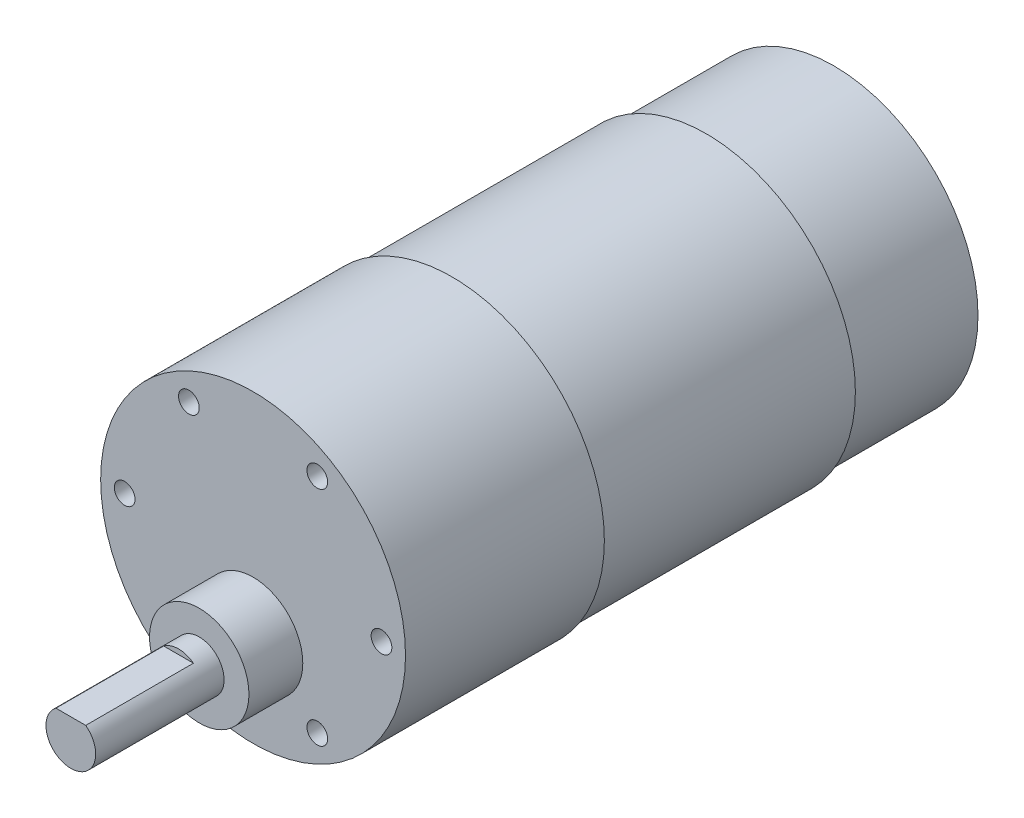
ISO-10303-21;
HEADER;
FILE_DESCRIPTION(('STEP AP214'),'2;1');
FILE_NAME('part.step','',(''),(''),'','','');
FILE_SCHEMA(('AUTOMOTIVE_DESIGN { 1 0 10303 214 1 1 1 1 }'));
ENDSEC;
DATA;
#1=APPLICATION_CONTEXT('core data for automotive mechanical design processes');
#2=APPLICATION_PROTOCOL_DEFINITION('international standard','automotive_design',2000,#1);
#3=PRODUCT_CONTEXT('',#1,'mechanical');
#4=PRODUCT('Part','Part','',(#3));
#5=PRODUCT_RELATED_PRODUCT_CATEGORY('part','',(#4));
#6=PRODUCT_DEFINITION_FORMATION('','',#4);
#7=PRODUCT_DEFINITION_CONTEXT('part definition',#1,'design');
#8=PRODUCT_DEFINITION('design','',#6,#7);
#9=PRODUCT_DEFINITION_SHAPE('','',#8);
#10=(LENGTH_UNIT() NAMED_UNIT(*) SI_UNIT(.MILLI.,.METRE.));
#11=(NAMED_UNIT(*) PLANE_ANGLE_UNIT() SI_UNIT($,.RADIAN.));
#12=(NAMED_UNIT(*) SI_UNIT($,.STERADIAN.) SOLID_ANGLE_UNIT());
#13=UNCERTAINTY_MEASURE_WITH_UNIT(LENGTH_MEASURE(1.E-05),#10,'distance_accuracy_value','');
#14=(GEOMETRIC_REPRESENTATION_CONTEXT(3) GLOBAL_UNCERTAINTY_ASSIGNED_CONTEXT((#13)) GLOBAL_UNIT_ASSIGNED_CONTEXT((#10,
#11,#12)) REPRESENTATION_CONTEXT('',''));
#15=CARTESIAN_POINT('',(0.,0.,0.));
#16=DIRECTION('',(0.,0.,1.));
#17=DIRECTION('',(1.,0.,0.));
#18=AXIS2_PLACEMENT_3D('',#15,#16,#17);
#19=CARTESIAN_POINT('',(0.,0.,15.4));
#20=DIRECTION('',(0.,0.,-1.));
#21=DIRECTION('',(-1.,0.,0.));
#22=AXIS2_PLACEMENT_3D('',#19,#20,#21);
#23=CYLINDRICAL_SURFACE('',#22,17.4);
#24=CARTESIAN_POINT('',(0.,0.,15.4));
#25=DIRECTION('',(0.,0.,1.));
#26=DIRECTION('',(1.,0.,0.));
#27=AXIS2_PLACEMENT_3D('',#24,#25,#26);
#28=CIRCLE('',#27,17.4);
#29=CARTESIAN_POINT('',(17.4,0.,15.4));
#30=VERTEX_POINT('',#29);
#31=EDGE_CURVE('E11',#30,#30,#28,.T.);
#32=ORIENTED_EDGE('',*,*,#31,.F.);
#33=EDGE_LOOP('',(#32));
#34=FACE_BOUND('',#33,.T.);
#35=CARTESIAN_POINT('',(0.,0.,0.));
#36=DIRECTION('',(0.,0.,1.));
#37=DIRECTION('',(1.,0.,0.));
#38=AXIS2_PLACEMENT_3D('',#35,#36,#37);
#39=CIRCLE('',#38,17.4);
#40=CARTESIAN_POINT('',(17.4,0.,0.));
#41=VERTEX_POINT('',#40);
#42=EDGE_CURVE('E37',#41,#41,#39,.T.);
#43=ORIENTED_EDGE('',*,*,#42,.T.);
#44=EDGE_LOOP('',(#43));
#45=FACE_BOUND('',#44,.T.);
#46=ADVANCED_FACE('F34',(#34,#45),#23,.T.);
#47=CARTESIAN_POINT('',(0.,0.,0.));
#48=DIRECTION('',(0.,0.,1.));
#49=DIRECTION('',(1.,0.,0.));
#50=AXIS2_PLACEMENT_3D('',#47,#48,#49);
#51=PLANE('',#50);
#52=ORIENTED_EDGE('',*,*,#42,.F.);
#53=EDGE_LOOP('',(#52));
#54=FACE_BOUND('',#53,.T.);
#55=ADVANCED_FACE('F113',(#54),#51,.F.);
#56=CARTESIAN_POINT('',(0.,0.,46.1));
#57=DIRECTION('',(0.,0.,-1.));
#58=DIRECTION('',(-1.,0.,0.));
#59=AXIS2_PLACEMENT_3D('',#56,#57,#58);
#60=CYLINDRICAL_SURFACE('',#59,18.);
#61=CARTESIAN_POINT('',(0.,0.,46.1));
#62=DIRECTION('',(0.,0.,1.));
#63=DIRECTION('',(1.,0.,0.));
#64=AXIS2_PLACEMENT_3D('',#61,#62,#63);
#65=CIRCLE('',#64,18.);
#66=CARTESIAN_POINT('',(18.,0.,46.1));
#67=VERTEX_POINT('',#66);
#68=EDGE_CURVE('E93',#67,#67,#65,.T.);
#69=ORIENTED_EDGE('',*,*,#68,.F.);
#70=EDGE_LOOP('',(#69));
#71=FACE_BOUND('',#70,.T.);
#72=CARTESIAN_POINT('',(0.,0.,15.4));
#73=DIRECTION('',(0.,0.,1.));
#74=DIRECTION('',(1.,0.,0.));
#75=AXIS2_PLACEMENT_3D('',#72,#73,#74);
#76=CIRCLE('',#75,18.);
#77=CARTESIAN_POINT('',(18.,0.,15.4));
#78=VERTEX_POINT('',#77);
#79=EDGE_CURVE('E90',#78,#78,#76,.T.);
#80=ORIENTED_EDGE('',*,*,#79,.T.);
#81=EDGE_LOOP('',(#80));
#82=FACE_BOUND('',#81,.T.);
#83=ADVANCED_FACE('F99',(#71,#82),#60,.T.);
#84=CARTESIAN_POINT('',(0.,0.,15.4));
#85=DIRECTION('',(0.,0.,1.));
#86=DIRECTION('',(1.,0.,0.));
#87=AXIS2_PLACEMENT_3D('',#84,#85,#86);
#88=PLANE('',#87);
#89=ORIENTED_EDGE('',*,*,#31,.T.);
#90=EDGE_LOOP('',(#89));
#91=FACE_BOUND('',#90,.T.);
#92=ORIENTED_EDGE('',*,*,#79,.F.);
#93=EDGE_LOOP('',(#92));
#94=FACE_BOUND('',#93,.T.);
#95=ADVANCED_FACE('F101',(#91,#94),#88,.F.);
#96=CARTESIAN_POINT('',(0.,0.,70.1));
#97=DIRECTION('',(0.,0.,-1.));
#98=DIRECTION('',(-1.,0.,0.));
#99=AXIS2_PLACEMENT_3D('',#96,#97,#98);
#100=CYLINDRICAL_SURFACE('',#99,18.4);
#101=CARTESIAN_POINT('',(0.,0.,70.1));
#102=DIRECTION('',(0.,0.,1.));
#103=DIRECTION('',(1.,0.,0.));
#104=AXIS2_PLACEMENT_3D('',#101,#102,#103);
#105=CIRCLE('',#104,18.4);
#106=CARTESIAN_POINT('',(18.4,0.,70.1));
#107=VERTEX_POINT('',#106);
#108=EDGE_CURVE('E87',#107,#107,#105,.T.);
#109=ORIENTED_EDGE('',*,*,#108,.F.);
#110=EDGE_LOOP('',(#109));
#111=FACE_BOUND('',#110,.T.);
#112=CARTESIAN_POINT('',(0.,0.,46.1));
#113=DIRECTION('',(0.,0.,1.));
#114=DIRECTION('',(1.,0.,0.));
#115=AXIS2_PLACEMENT_3D('',#112,#113,#114);
#116=CIRCLE('',#115,18.4);
#117=CARTESIAN_POINT('',(18.4,0.,46.1));
#118=VERTEX_POINT('',#117);
#119=EDGE_CURVE('E85',#118,#118,#116,.T.);
#120=ORIENTED_EDGE('',*,*,#119,.T.);
#121=EDGE_LOOP('',(#120));
#122=FACE_BOUND('',#121,.T.);
#123=ADVANCED_FACE('F103',(#111,#122),#100,.T.);
#124=CARTESIAN_POINT('',(0.,0.,70.1));
#125=DIRECTION('',(0.,0.,1.));
#126=DIRECTION('',(1.,0.,0.));
#127=AXIS2_PLACEMENT_3D('',#124,#125,#126);
#128=PLANE('',#127);
#129=CARTESIAN_POINT('',(-15.5,0.,70.1));
#130=DIRECTION('',(0.,0.,1.));
#131=DIRECTION('',(1.,0.,0.));
#132=AXIS2_PLACEMENT_3D('',#129,#130,#131);
#133=CIRCLE('',#132,1.25);
#134=CARTESIAN_POINT('',(-14.25,0.,70.1));
#135=VERTEX_POINT('',#134);
#136=EDGE_CURVE('E345',#135,#135,#133,.T.);
#137=ORIENTED_EDGE('',*,*,#136,.F.);
#138=EDGE_LOOP('',(#137));
#139=FACE_BOUND('',#138,.T.);
#140=CARTESIAN_POINT('',(-7.74999999999997,13.4233937586588,70.1));
#141=DIRECTION('',(0.,0.,1.));
#142=DIRECTION('',(1.,0.,0.));
#143=AXIS2_PLACEMENT_3D('',#140,#141,#142);
#144=CIRCLE('',#143,1.25);
#145=CARTESIAN_POINT('',(-6.49999999999997,13.4233937586588,70.1));
#146=VERTEX_POINT('',#145);
#147=EDGE_CURVE('E347',#146,#146,#144,.T.);
#148=ORIENTED_EDGE('',*,*,#147,.F.);
#149=EDGE_LOOP('',(#148));
#150=FACE_BOUND('',#149,.T.);
#151=CARTESIAN_POINT('',(7.75000000000006,13.4233937586588,70.1));
#152=DIRECTION('',(0.,0.,1.));
#153=DIRECTION('',(1.,0.,0.));
#154=AXIS2_PLACEMENT_3D('',#151,#152,#153);
#155=CIRCLE('',#154,1.25);
#156=CARTESIAN_POINT('',(9.00000000000006,13.4233937586588,70.1));
#157=VERTEX_POINT('',#156);
#158=EDGE_CURVE('E355',#157,#157,#155,.T.);
#159=ORIENTED_EDGE('',*,*,#158,.F.);
#160=EDGE_LOOP('',(#159));
#161=FACE_BOUND('',#160,.T.);
#162=CARTESIAN_POINT('',(15.5,-1.08235921504137E-13,70.1));
#163=DIRECTION('',(0.,0.,1.));
#164=DIRECTION('',(1.,0.,0.));
#165=AXIS2_PLACEMENT_3D('',#162,#163,#164);
#166=CIRCLE('',#165,1.25);
#167=CARTESIAN_POINT('',(16.75,-1.08235921504137E-13,70.1));
#168=VERTEX_POINT('',#167);
#169=EDGE_CURVE('E361',#168,#168,#166,.T.);
#170=ORIENTED_EDGE('',*,*,#169,.F.);
#171=EDGE_LOOP('',(#170));
#172=FACE_BOUND('',#171,.T.);
#173=CARTESIAN_POINT('',(7.74999999999987,-13.4233937586589,70.1));
#174=DIRECTION('',(0.,0.,1.));
#175=DIRECTION('',(1.,0.,0.));
#176=AXIS2_PLACEMENT_3D('',#173,#174,#175);
#177=CIRCLE('',#176,1.25);
#178=CARTESIAN_POINT('',(8.99999999999987,-13.4233937586589,70.1));
#179=VERTEX_POINT('',#178);
#180=EDGE_CURVE('E367',#179,#179,#177,.T.);
#181=ORIENTED_EDGE('',*,*,#180,.F.);
#182=EDGE_LOOP('',(#181));
#183=FACE_BOUND('',#182,.T.);
#184=CARTESIAN_POINT('',(-7.75000000000016,-13.4233937586587,70.1));
#185=DIRECTION('',(0.,0.,1.));
#186=DIRECTION('',(1.,0.,0.));
#187=AXIS2_PLACEMENT_3D('',#184,#185,#186);
#188=CIRCLE('',#187,1.25);
#189=CARTESIAN_POINT('',(-6.50000000000016,-13.4233937586587,70.1));
#190=VERTEX_POINT('',#189);
#191=EDGE_CURVE('E373',#190,#190,#188,.T.);
#192=ORIENTED_EDGE('',*,*,#191,.F.);
#193=EDGE_LOOP('',(#192));
#194=FACE_BOUND('',#193,.T.);
#195=CARTESIAN_POINT('',(0.,-7.,70.1));
#196=DIRECTION('',(0.,0.,1.));
#197=DIRECTION('',(1.,0.,0.));
#198=AXIS2_PLACEMENT_3D('',#195,#196,#197);
#199=CIRCLE('',#198,6.);
#200=CARTESIAN_POINT('',(6.,-7.,70.1));
#201=VERTEX_POINT('',#200);
#202=EDGE_CURVE('E75',#201,#201,#199,.T.);
#203=ORIENTED_EDGE('',*,*,#202,.F.);
#204=EDGE_LOOP('',(#203));
#205=FACE_BOUND('',#204,.T.);
#206=ORIENTED_EDGE('',*,*,#108,.T.);
#207=EDGE_LOOP('',(#206));
#208=FACE_BOUND('',#207,.T.);
#209=ADVANCED_FACE('F110',(#139,#150,#161,#172,#183,#194,#205,#208),#128,.T.);
#210=CARTESIAN_POINT('',(0.,0.,46.1));
#211=DIRECTION('',(0.,0.,1.));
#212=DIRECTION('',(1.,0.,0.));
#213=AXIS2_PLACEMENT_3D('',#210,#211,#212);
#214=PLANE('',#213);
#215=ORIENTED_EDGE('',*,*,#68,.T.);
#216=EDGE_LOOP('',(#215));
#217=FACE_BOUND('',#216,.T.);
#218=ORIENTED_EDGE('',*,*,#119,.F.);
#219=EDGE_LOOP('',(#218));
#220=FACE_BOUND('',#219,.T.);
#221=ADVANCED_FACE('F149',(#217,#220),#214,.F.);
#222=CARTESIAN_POINT('',(0.,-7.,76.6));
#223=DIRECTION('',(0.,0.,-1.));
#224=DIRECTION('',(-1.,0.,0.));
#225=AXIS2_PLACEMENT_3D('',#222,#223,#224);
#226=CYLINDRICAL_SURFACE('',#225,6.);
#227=CARTESIAN_POINT('',(0.,-7.,76.6));
#228=DIRECTION('',(0.,0.,1.));
#229=DIRECTION('',(1.,0.,0.));
#230=AXIS2_PLACEMENT_3D('',#227,#228,#229);
#231=CIRCLE('',#230,6.);
#232=CARTESIAN_POINT('',(6.,-7.,76.6));
#233=VERTEX_POINT('',#232);
#234=EDGE_CURVE('E78',#233,#233,#231,.T.);
#235=ORIENTED_EDGE('',*,*,#234,.F.);
#236=EDGE_LOOP('',(#235));
#237=FACE_BOUND('',#236,.T.);
#238=ORIENTED_EDGE('',*,*,#202,.T.);
#239=EDGE_LOOP('',(#238));
#240=FACE_BOUND('',#239,.T.);
#241=ADVANCED_FACE('F154',(#237,#240),#226,.T.);
#242=CARTESIAN_POINT('',(0.,-7.,76.6));
#243=DIRECTION('',(0.,0.,1.));
#244=DIRECTION('',(1.,0.,0.));
#245=AXIS2_PLACEMENT_3D('',#242,#243,#244);
#246=PLANE('',#245);
#247=CARTESIAN_POINT('',(0.,-7.,76.6));
#248=DIRECTION('',(0.,0.,1.));
#249=DIRECTION('',(1.,0.,0.));
#250=AXIS2_PLACEMENT_3D('',#247,#248,#249);
#251=CIRCLE('',#250,3.);
#252=CARTESIAN_POINT('',(3.,-7.,76.6));
#253=VERTEX_POINT('',#252);
#254=EDGE_CURVE('E72',#253,#253,#251,.T.);
#255=ORIENTED_EDGE('',*,*,#254,.F.);
#256=EDGE_LOOP('',(#255));
#257=FACE_BOUND('',#256,.T.);
#258=ORIENTED_EDGE('',*,*,#234,.T.);
#259=EDGE_LOOP('',(#258));
#260=FACE_BOUND('',#259,.T.);
#261=ADVANCED_FACE('F164',(#257,#260),#246,.T.);
#262=CARTESIAN_POINT('',(0.,-7.,92.1));
#263=DIRECTION('',(0.,0.,-1.));
#264=DIRECTION('',(-1.,0.,0.));
#265=AXIS2_PLACEMENT_3D('',#262,#263,#264);
#266=CYLINDRICAL_SURFACE('',#265,3.);
#267=CARTESIAN_POINT('',(0.,-7.,92.1));
#268=DIRECTION('',(0.,0.,1.));
#269=DIRECTION('',(1.,0.,0.));
#270=AXIS2_PLACEMENT_3D('',#267,#268,#269);
#271=CIRCLE('',#270,3.);
#272=CARTESIAN_POINT('',(-1.8,-4.6,92.1));
#273=VERTEX_POINT('',#272);
#274=CARTESIAN_POINT('',(1.8,-4.6,92.1));
#275=VERTEX_POINT('',#274);
#276=EDGE_CURVE('E71',#273,#275,#271,.T.);
#277=ORIENTED_EDGE('',*,*,#276,.F.);
#278=DIRECTION('',(0.,0.,1.));
#279=VECTOR('',#278,1.);
#280=CARTESIAN_POINT('',(-1.8,-4.6,79.1));
#281=LINE('',#280,#279);
#282=CARTESIAN_POINT('',(-1.8,-4.6,79.1));
#283=VERTEX_POINT('',#282);
#284=EDGE_CURVE('E48',#283,#273,#281,.T.);
#285=ORIENTED_EDGE('',*,*,#284,.F.);
#286=CARTESIAN_POINT('',(0.,-7.00000000000001,79.1));
#287=DIRECTION('',(0.,0.,1.));
#288=DIRECTION('',(-1.,0.,0.));
#289=AXIS2_PLACEMENT_3D('',#286,#287,#288);
#290=CIRCLE('',#289,3.00000000000001);
#291=CARTESIAN_POINT('',(1.8,-4.6,79.1));
#292=VERTEX_POINT('',#291);
#293=EDGE_CURVE('E64',#292,#283,#290,.T.);
#294=ORIENTED_EDGE('',*,*,#293,.F.);
#295=DIRECTION('',(0.,0.,1.));
#296=VECTOR('',#295,1.);
#297=CARTESIAN_POINT('',(1.8,-4.6,79.1));
#298=LINE('',#297,#296);
#299=EDGE_CURVE('E54',#292,#275,#298,.T.);
#300=ORIENTED_EDGE('',*,*,#299,.T.);
#301=EDGE_LOOP('',(#277,#285,#294,#300));
#302=FACE_BOUND('',#301,.T.);
#303=ORIENTED_EDGE('',*,*,#254,.T.);
#304=EDGE_LOOP('',(#303));
#305=FACE_BOUND('',#304,.T.);
#306=ADVANCED_FACE('F69',(#302,#305),#266,.T.);
#307=CARTESIAN_POINT('',(0.,-7.,92.1));
#308=DIRECTION('',(0.,0.,1.));
#309=DIRECTION('',(1.,0.,0.));
#310=AXIS2_PLACEMENT_3D('',#307,#308,#309);
#311=PLANE('',#310);
#312=DIRECTION('',(1.,0.,0.));
#313=VECTOR('',#312,1.);
#314=CARTESIAN_POINT('',(-1.8,-4.6,92.1));
#315=LINE('',#314,#313);
#316=EDGE_CURVE('E59',#273,#275,#315,.T.);
#317=ORIENTED_EDGE('',*,*,#316,.F.);
#318=ORIENTED_EDGE('',*,*,#276,.T.);
#319=EDGE_LOOP('',(#317,#318));
#320=FACE_BOUND('',#319,.T.);
#321=ADVANCED_FACE('F74',(#320),#311,.T.);
#322=CARTESIAN_POINT('',(-1.8,-4.6,79.1));
#323=DIRECTION('',(0.,-1.,0.));
#324=DIRECTION('',(0.,0.,-1.));
#325=AXIS2_PLACEMENT_3D('',#322,#323,#324);
#326=PLANE('',#325);
#327=ORIENTED_EDGE('',*,*,#316,.T.);
#328=ORIENTED_EDGE('',*,*,#299,.F.);
#329=DIRECTION('',(1.,0.,0.));
#330=VECTOR('',#329,1.);
#331=CARTESIAN_POINT('',(-1.8,-4.6,79.1));
#332=LINE('',#331,#330);
#333=EDGE_CURVE('E379',#283,#292,#332,.T.);
#334=ORIENTED_EDGE('',*,*,#333,.F.);
#335=ORIENTED_EDGE('',*,*,#284,.T.);
#336=EDGE_LOOP('',(#327,#328,#334,#335));
#337=FACE_BOUND('',#336,.T.);
#338=ADVANCED_FACE('F60',(#337),#326,.F.);
#339=CARTESIAN_POINT('',(0.,-7.00000000000001,79.1));
#340=DIRECTION('',(0.,0.,-1.));
#341=DIRECTION('',(-1.,0.,0.));
#342=AXIS2_PLACEMENT_3D('',#339,#340,#341);
#343=PLANE('',#342);
#344=ORIENTED_EDGE('',*,*,#293,.T.);
#345=ORIENTED_EDGE('',*,*,#333,.T.);
#346=EDGE_LOOP('',(#344,#345));
#347=FACE_BOUND('',#346,.T.);
#348=ADVANCED_FACE('F199',(#347),#343,.F.);
#349=CARTESIAN_POINT('',(-7.75000000000016,-13.4233937586587,59.34));
#350=DIRECTION('',(0.,0.,-1.));
#351=DIRECTION('',(-1.,0.,0.));
#352=AXIS2_PLACEMENT_3D('',#349,#350,#351);
#353=PLANE('',#352);
#354=CARTESIAN_POINT('',(-7.75000000000016,-13.4233937586587,59.34));
#355=DIRECTION('',(0.,0.,1.));
#356=DIRECTION('',(1.,0.,0.));
#357=AXIS2_PLACEMENT_3D('',#354,#355,#356);
#358=CIRCLE('',#357,1.25);
#359=CARTESIAN_POINT('',(-6.50000000000016,-13.4233937586587,59.34));
#360=VERTEX_POINT('',#359);
#361=EDGE_CURVE('E65',#360,#360,#358,.T.);
#362=ORIENTED_EDGE('',*,*,#361,.T.);
#363=EDGE_LOOP('',(#362));
#364=FACE_BOUND('',#363,.T.);
#365=ADVANCED_FACE('F208',(#364),#353,.F.);
#366=CARTESIAN_POINT('',(-7.75000000000016,-13.4233937586587,70.1));
#367=DIRECTION('',(0.,0.,1.));
#368=DIRECTION('',(1.,0.,0.));
#369=AXIS2_PLACEMENT_3D('',#366,#367,#368);
#370=CYLINDRICAL_SURFACE('',#369,1.25);
#371=ORIENTED_EDGE('',*,*,#361,.F.);
#372=EDGE_LOOP('',(#371));
#373=FACE_BOUND('',#372,.T.);
#374=ORIENTED_EDGE('',*,*,#191,.T.);
#375=EDGE_LOOP('',(#374));
#376=FACE_BOUND('',#375,.T.);
#377=ADVANCED_FACE('F225',(#373,#376),#370,.F.);
#378=CARTESIAN_POINT('',(7.74999999999987,-13.4233937586589,59.34));
#379=DIRECTION('',(0.,0.,-1.));
#380=DIRECTION('',(-1.,0.,0.));
#381=AXIS2_PLACEMENT_3D('',#378,#379,#380);
#382=PLANE('',#381);
#383=CARTESIAN_POINT('',(7.74999999999987,-13.4233937586589,59.34));
#384=DIRECTION('',(0.,0.,1.));
#385=DIRECTION('',(1.,0.,0.));
#386=AXIS2_PLACEMENT_3D('',#383,#384,#385);
#387=CIRCLE('',#386,1.25);
#388=CARTESIAN_POINT('',(8.99999999999987,-13.4233937586589,59.34));
#389=VERTEX_POINT('',#388);
#390=EDGE_CURVE('E370',#389,#389,#387,.T.);
#391=ORIENTED_EDGE('',*,*,#390,.T.);
#392=EDGE_LOOP('',(#391));
#393=FACE_BOUND('',#392,.T.);
#394=ADVANCED_FACE('F235',(#393),#382,.F.);
#395=CARTESIAN_POINT('',(7.74999999999987,-13.4233937586589,70.1));
#396=DIRECTION('',(0.,0.,1.));
#397=DIRECTION('',(1.,0.,0.));
#398=AXIS2_PLACEMENT_3D('',#395,#396,#397);
#399=CYLINDRICAL_SURFACE('',#398,1.25);
#400=ORIENTED_EDGE('',*,*,#390,.F.);
#401=EDGE_LOOP('',(#400));
#402=FACE_BOUND('',#401,.T.);
#403=ORIENTED_EDGE('',*,*,#180,.T.);
#404=EDGE_LOOP('',(#403));
#405=FACE_BOUND('',#404,.T.);
#406=ADVANCED_FACE('F245',(#402,#405),#399,.F.);
#407=CARTESIAN_POINT('',(15.5,-1.08235921504137E-13,59.34));
#408=DIRECTION('',(0.,0.,-1.));
#409=DIRECTION('',(-1.,0.,0.));
#410=AXIS2_PLACEMENT_3D('',#407,#408,#409);
#411=PLANE('',#410);
#412=CARTESIAN_POINT('',(15.5,-1.08235921504137E-13,59.34));
#413=DIRECTION('',(0.,0.,1.));
#414=DIRECTION('',(1.,0.,0.));
#415=AXIS2_PLACEMENT_3D('',#412,#413,#414);
#416=CIRCLE('',#415,1.25);
#417=CARTESIAN_POINT('',(16.75,-1.08235921504137E-13,59.34));
#418=VERTEX_POINT('',#417);
#419=EDGE_CURVE('E364',#418,#418,#416,.T.);
#420=ORIENTED_EDGE('',*,*,#419,.T.);
#421=EDGE_LOOP('',(#420));
#422=FACE_BOUND('',#421,.T.);
#423=ADVANCED_FACE('F255',(#422),#411,.F.);
#424=CARTESIAN_POINT('',(15.5,-1.08235921504137E-13,70.1));
#425=DIRECTION('',(0.,0.,1.));
#426=DIRECTION('',(1.,0.,0.));
#427=AXIS2_PLACEMENT_3D('',#424,#425,#426);
#428=CYLINDRICAL_SURFACE('',#427,1.25);
#429=ORIENTED_EDGE('',*,*,#419,.F.);
#430=EDGE_LOOP('',(#429));
#431=FACE_BOUND('',#430,.T.);
#432=ORIENTED_EDGE('',*,*,#169,.T.);
#433=EDGE_LOOP('',(#432));
#434=FACE_BOUND('',#433,.T.);
#435=ADVANCED_FACE('F265',(#431,#434),#428,.F.);
#436=CARTESIAN_POINT('',(7.75000000000006,13.4233937586588,59.34));
#437=DIRECTION('',(0.,0.,-1.));
#438=DIRECTION('',(-1.,0.,0.));
#439=AXIS2_PLACEMENT_3D('',#436,#437,#438);
#440=PLANE('',#439);
#441=CARTESIAN_POINT('',(7.75000000000006,13.4233937586588,59.34));
#442=DIRECTION('',(0.,0.,1.));
#443=DIRECTION('',(1.,0.,0.));
#444=AXIS2_PLACEMENT_3D('',#441,#442,#443);
#445=CIRCLE('',#444,1.25);
#446=CARTESIAN_POINT('',(9.00000000000006,13.4233937586588,59.34));
#447=VERTEX_POINT('',#446);
#448=EDGE_CURVE('E358',#447,#447,#445,.T.);
#449=ORIENTED_EDGE('',*,*,#448,.T.);
#450=EDGE_LOOP('',(#449));
#451=FACE_BOUND('',#450,.T.);
#452=ADVANCED_FACE('F275',(#451),#440,.F.);
#453=CARTESIAN_POINT('',(7.75000000000006,13.4233937586588,70.1));
#454=DIRECTION('',(0.,0.,1.));
#455=DIRECTION('',(1.,0.,0.));
#456=AXIS2_PLACEMENT_3D('',#453,#454,#455);
#457=CYLINDRICAL_SURFACE('',#456,1.25);
#458=ORIENTED_EDGE('',*,*,#448,.F.);
#459=EDGE_LOOP('',(#458));
#460=FACE_BOUND('',#459,.T.);
#461=ORIENTED_EDGE('',*,*,#158,.T.);
#462=EDGE_LOOP('',(#461));
#463=FACE_BOUND('',#462,.T.);
#464=ADVANCED_FACE('F285',(#460,#463),#457,.F.);
#465=CARTESIAN_POINT('',(-7.74999999999997,13.4233937586588,59.34));
#466=DIRECTION('',(0.,0.,-1.));
#467=DIRECTION('',(-1.,0.,0.));
#468=AXIS2_PLACEMENT_3D('',#465,#466,#467);
#469=PLANE('',#468);
#470=CARTESIAN_POINT('',(-7.74999999999997,13.4233937586588,59.34));
#471=DIRECTION('',(0.,0.,1.));
#472=DIRECTION('',(1.,0.,0.));
#473=AXIS2_PLACEMENT_3D('',#470,#471,#472);
#474=CIRCLE('',#473,1.25);
#475=CARTESIAN_POINT('',(-6.49999999999997,13.4233937586588,59.34));
#476=VERTEX_POINT('',#475);
#477=EDGE_CURVE('E352',#476,#476,#474,.T.);
#478=ORIENTED_EDGE('',*,*,#477,.T.);
#479=EDGE_LOOP('',(#478));
#480=FACE_BOUND('',#479,.T.);
#481=ADVANCED_FACE('F295',(#480),#469,.F.);
#482=CARTESIAN_POINT('',(-7.74999999999997,13.4233937586588,70.1));
#483=DIRECTION('',(0.,0.,1.));
#484=DIRECTION('',(1.,0.,0.));
#485=AXIS2_PLACEMENT_3D('',#482,#483,#484);
#486=CYLINDRICAL_SURFACE('',#485,1.25);
#487=ORIENTED_EDGE('',*,*,#477,.F.);
#488=EDGE_LOOP('',(#487));
#489=FACE_BOUND('',#488,.T.);
#490=ORIENTED_EDGE('',*,*,#147,.T.);
#491=EDGE_LOOP('',(#490));
#492=FACE_BOUND('',#491,.T.);
#493=ADVANCED_FACE('F305',(#489,#492),#486,.F.);
#494=CARTESIAN_POINT('',(-15.5,0.,59.34));
#495=DIRECTION('',(0.,0.,-1.));
#496=DIRECTION('',(-1.,0.,0.));
#497=AXIS2_PLACEMENT_3D('',#494,#495,#496);
#498=PLANE('',#497);
#499=CARTESIAN_POINT('',(-15.5,0.,59.34));
#500=DIRECTION('',(0.,0.,1.));
#501=DIRECTION('',(1.,0.,0.));
#502=AXIS2_PLACEMENT_3D('',#499,#500,#501);
#503=CIRCLE('',#502,1.25);
#504=CARTESIAN_POINT('',(-14.25,0.,59.34));
#505=VERTEX_POINT('',#504);
#506=EDGE_CURVE('E342',#505,#505,#503,.T.);
#507=ORIENTED_EDGE('',*,*,#506,.T.);
#508=EDGE_LOOP('',(#507));
#509=FACE_BOUND('',#508,.T.);
#510=ADVANCED_FACE('F315',(#509),#498,.F.);
#511=CARTESIAN_POINT('',(-15.5,0.,70.1));
#512=DIRECTION('',(0.,0.,1.));
#513=DIRECTION('',(1.,0.,0.));
#514=AXIS2_PLACEMENT_3D('',#511,#512,#513);
#515=CYLINDRICAL_SURFACE('',#514,1.25);
#516=ORIENTED_EDGE('',*,*,#506,.F.);
#517=EDGE_LOOP('',(#516));
#518=FACE_BOUND('',#517,.T.);
#519=ORIENTED_EDGE('',*,*,#136,.T.);
#520=EDGE_LOOP('',(#519));
#521=FACE_BOUND('',#520,.T.);
#522=ADVANCED_FACE('F325',(#518,#521),#515,.F.);
#523=CLOSED_SHELL('',(#46,#55,#83,#95,#123,#209,#221,#241,#261,#306,#321,#338,#348,#365,#377,
#394,#406,#423,#435,#452,#464,#481,#493,#510,#522));
#524=MANIFOLD_SOLID_BREP('B2',#523);
#525=ADVANCED_BREP_SHAPE_REPRESENTATION('',(#18,#524),#14);
#526=SHAPE_DEFINITION_REPRESENTATION(#9,#525);
ENDSEC;
END-ISO-10303-21;
